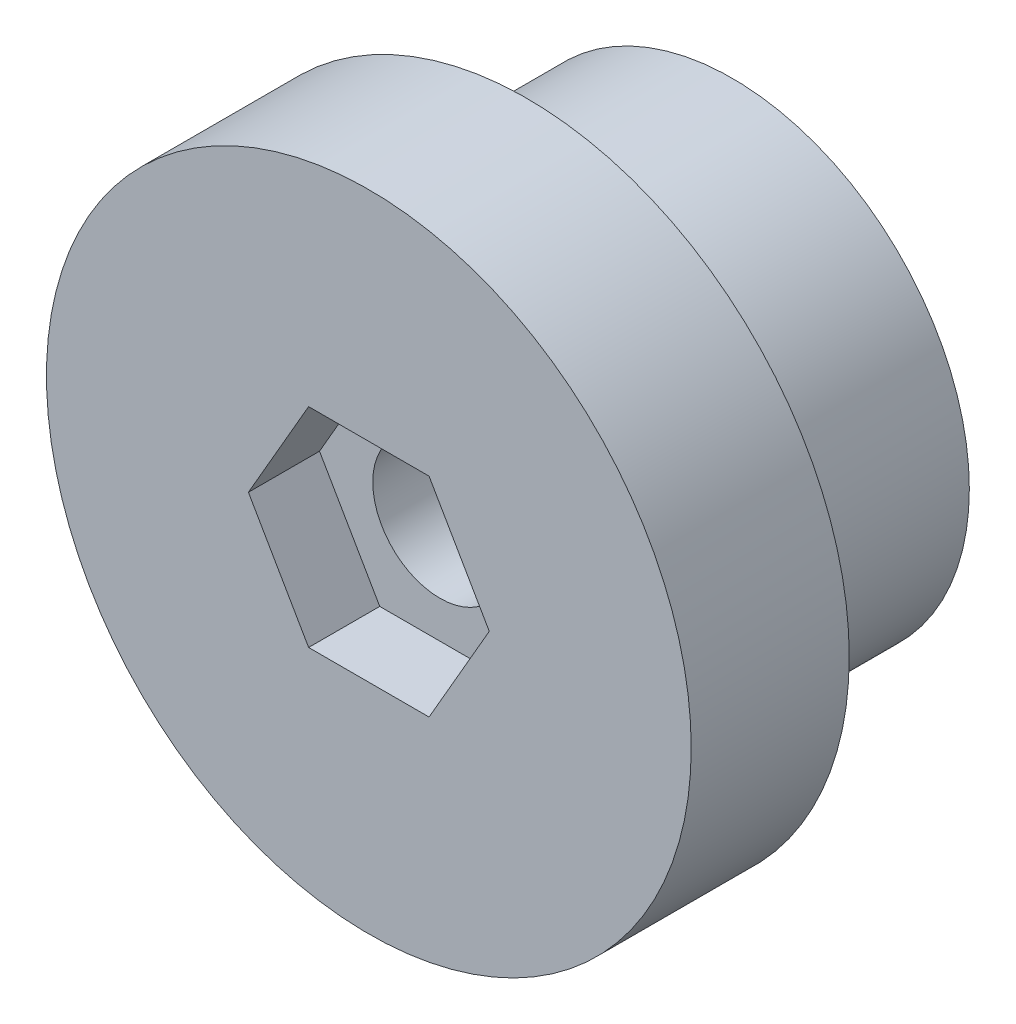
ISO-10303-21;
HEADER;
FILE_DESCRIPTION(('STEP AP214'),'2;1');
FILE_NAME('part.step','',(''),(''),'','','');
FILE_SCHEMA(('AUTOMOTIVE_DESIGN { 1 0 10303 214 1 1 1 1 }'));
ENDSEC;
DATA;
#1=APPLICATION_CONTEXT('core data for automotive mechanical design processes');
#2=APPLICATION_PROTOCOL_DEFINITION('international standard','automotive_design',2000,#1);
#3=PRODUCT_CONTEXT('',#1,'mechanical');
#4=PRODUCT('Part','Part','',(#3));
#5=PRODUCT_RELATED_PRODUCT_CATEGORY('part','',(#4));
#6=PRODUCT_DEFINITION_FORMATION('','',#4);
#7=PRODUCT_DEFINITION_CONTEXT('part definition',#1,'design');
#8=PRODUCT_DEFINITION('design','',#6,#7);
#9=PRODUCT_DEFINITION_SHAPE('','',#8);
#10=(LENGTH_UNIT() NAMED_UNIT(*) SI_UNIT(.MILLI.,.METRE.));
#11=(NAMED_UNIT(*) PLANE_ANGLE_UNIT() SI_UNIT($,.RADIAN.));
#12=(NAMED_UNIT(*) SI_UNIT($,.STERADIAN.) SOLID_ANGLE_UNIT());
#13=UNCERTAINTY_MEASURE_WITH_UNIT(LENGTH_MEASURE(1.E-05),#10,'distance_accuracy_value','');
#14=(GEOMETRIC_REPRESENTATION_CONTEXT(3) GLOBAL_UNCERTAINTY_ASSIGNED_CONTEXT((#13)) GLOBAL_UNIT_ASSIGNED_CONTEXT((#10,
#11,#12)) REPRESENTATION_CONTEXT('',''));
#15=CARTESIAN_POINT('',(0.,0.,0.));
#16=DIRECTION('',(0.,0.,1.));
#17=DIRECTION('',(1.,0.,0.));
#18=AXIS2_PLACEMENT_3D('',#15,#16,#17);
#19=CARTESIAN_POINT('',(0.,0.,0.));
#20=DIRECTION('',(0.,0.,1.));
#21=DIRECTION('',(1.,0.,0.));
#22=AXIS2_PLACEMENT_3D('',#19,#20,#21);
#23=PLANE('',#22);
#24=CARTESIAN_POINT('',(0.,0.,0.));
#25=DIRECTION('',(0.,0.,1.));
#26=DIRECTION('',(1.,0.,0.));
#27=AXIS2_PLACEMENT_3D('',#24,#25,#26);
#28=CIRCLE('',#27,20.4);
#29=CARTESIAN_POINT('',(20.4,0.,0.));
#30=VERTEX_POINT('',#29);
#31=EDGE_CURVE('E144',#30,#30,#28,.T.);
#32=ORIENTED_EDGE('',*,*,#31,.F.);
#33=EDGE_LOOP('',(#32));
#34=FACE_BOUND('',#33,.T.);
#35=CARTESIAN_POINT('',(0.,0.,0.));
#36=DIRECTION('',(0.,0.,1.));
#37=DIRECTION('',(1.,0.,0.));
#38=AXIS2_PLACEMENT_3D('',#35,#36,#37);
#39=CIRCLE('',#38,15.);
#40=CARTESIAN_POINT('',(15.,0.,0.));
#41=VERTEX_POINT('',#40);
#42=EDGE_CURVE('E11',#41,#41,#39,.F.);
#43=ORIENTED_EDGE('',*,*,#42,.F.);
#44=EDGE_LOOP('',(#43));
#45=FACE_BOUND('',#44,.T.);
#46=ADVANCED_FACE('F33',(#34,#45),#23,.F.);
#47=CARTESIAN_POINT('',(0.,0.,10.));
#48=DIRECTION('',(0.,0.,-1.));
#49=DIRECTION('',(-1.,0.,0.));
#50=AXIS2_PLACEMENT_3D('',#47,#48,#49);
#51=CYLINDRICAL_SURFACE('',#50,4.25);
#52=CARTESIAN_POINT('',(0.,0.,5.5));
#53=DIRECTION('',(0.,0.,1.));
#54=DIRECTION('',(1.,0.,0.));
#55=AXIS2_PLACEMENT_3D('',#52,#53,#54);
#56=CIRCLE('',#55,4.25);
#57=CARTESIAN_POINT('',(4.25,0.,5.5));
#58=VERTEX_POINT('',#57);
#59=EDGE_CURVE('E136',#58,#58,#56,.T.);
#60=ORIENTED_EDGE('',*,*,#59,.T.);
#61=EDGE_LOOP('',(#60));
#62=FACE_BOUND('',#61,.T.);
#63=CARTESIAN_POINT('',(0.,0.,-13.));
#64=DIRECTION('',(0.,0.,-1.));
#65=DIRECTION('',(-1.,0.,0.));
#66=AXIS2_PLACEMENT_3D('',#63,#64,#65);
#67=CIRCLE('',#66,4.25);
#68=CARTESIAN_POINT('',(-4.25,0.,-13.));
#69=VERTEX_POINT('',#68);
#70=EDGE_CURVE('E204',#69,#69,#67,.T.);
#71=ORIENTED_EDGE('',*,*,#70,.T.);
#72=EDGE_LOOP('',(#71));
#73=FACE_BOUND('',#72,.T.);
#74=ADVANCED_FACE('F149',(#62,#73),#51,.F.);
#75=CARTESIAN_POINT('',(0.,0.,10.));
#76=DIRECTION('',(0.,0.,1.));
#77=DIRECTION('',(1.,0.,0.));
#78=AXIS2_PLACEMENT_3D('',#75,#76,#77);
#79=PLANE('',#78);
#80=DIRECTION('',(1.,0.,0.));
#81=VECTOR('',#80,1.);
#82=CARTESIAN_POINT('',(-3.81051177665153,-6.6,10.));
#83=LINE('',#82,#81);
#84=CARTESIAN_POINT('',(-3.81051177665153,-6.6,10.));
#85=VERTEX_POINT('',#84);
#86=CARTESIAN_POINT('',(3.81051177665153,-6.6,10.));
#87=VERTEX_POINT('',#86);
#88=EDGE_CURVE('E48',#85,#87,#83,.T.);
#89=ORIENTED_EDGE('',*,*,#88,.F.);
#90=DIRECTION('',(0.5,-0.866025403784439,0.));
#91=VECTOR('',#90,1.);
#92=CARTESIAN_POINT('',(-7.62102355330306,0.,10.));
#93=LINE('',#92,#91);
#94=CARTESIAN_POINT('',(-7.62102355330306,0.,10.));
#95=VERTEX_POINT('',#94);
#96=EDGE_CURVE('E132',#95,#85,#93,.T.);
#97=ORIENTED_EDGE('',*,*,#96,.F.);
#98=DIRECTION('',(-0.5,-0.866025403784438,0.));
#99=VECTOR('',#98,1.);
#100=CARTESIAN_POINT('',(-3.81051177665153,6.6,10.));
#101=LINE('',#100,#99);
#102=CARTESIAN_POINT('',(-3.81051177665153,6.6,10.));
#103=VERTEX_POINT('',#102);
#104=EDGE_CURVE('E130',#103,#95,#101,.T.);
#105=ORIENTED_EDGE('',*,*,#104,.F.);
#106=DIRECTION('',(-1.,0.,0.));
#107=VECTOR('',#106,1.);
#108=CARTESIAN_POINT('',(3.81051177665153,6.6,10.));
#109=LINE('',#108,#107);
#110=CARTESIAN_POINT('',(3.81051177665153,6.6,10.));
#111=VERTEX_POINT('',#110);
#112=EDGE_CURVE('E96',#111,#103,#109,.T.);
#113=ORIENTED_EDGE('',*,*,#112,.F.);
#114=DIRECTION('',(-0.5,0.866025403784439,0.));
#115=VECTOR('',#114,1.);
#116=CARTESIAN_POINT('',(7.62102355330306,0.,10.));
#117=LINE('',#116,#115);
#118=CARTESIAN_POINT('',(7.62102355330306,0.,10.));
#119=VERTEX_POINT('',#118);
#120=EDGE_CURVE('E126',#119,#111,#117,.T.);
#121=ORIENTED_EDGE('',*,*,#120,.F.);
#122=DIRECTION('',(0.5,0.866025403784439,0.));
#123=VECTOR('',#122,1.);
#124=CARTESIAN_POINT('',(3.81051177665153,-6.6,10.));
#125=LINE('',#124,#123);
#126=EDGE_CURVE('E122',#87,#119,#125,.T.);
#127=ORIENTED_EDGE('',*,*,#126,.F.);
#128=EDGE_LOOP('',(#89,#97,#105,#113,#121,#127));
#129=FACE_BOUND('',#128,.T.);
#130=CARTESIAN_POINT('',(0.,0.,10.));
#131=DIRECTION('',(0.,0.,1.));
#132=DIRECTION('',(1.,0.,0.));
#133=AXIS2_PLACEMENT_3D('',#130,#131,#132);
#134=CIRCLE('',#133,20.4);
#135=CARTESIAN_POINT('',(20.4,0.,10.));
#136=VERTEX_POINT('',#135);
#137=EDGE_CURVE('E41',#136,#136,#134,.T.);
#138=ORIENTED_EDGE('',*,*,#137,.T.);
#139=EDGE_LOOP('',(#138));
#140=FACE_BOUND('',#139,.T.);
#141=ADVANCED_FACE('F175',(#129,#140),#79,.T.);
#142=CARTESIAN_POINT('',(0.,0.,10.));
#143=DIRECTION('',(0.,0.,-1.));
#144=DIRECTION('',(-1.,0.,0.));
#145=AXIS2_PLACEMENT_3D('',#142,#143,#144);
#146=CYLINDRICAL_SURFACE('',#145,20.4);
#147=ORIENTED_EDGE('',*,*,#137,.F.);
#148=EDGE_LOOP('',(#147));
#149=FACE_BOUND('',#148,.T.);
#150=ORIENTED_EDGE('',*,*,#31,.T.);
#151=EDGE_LOOP('',(#150));
#152=FACE_BOUND('',#151,.T.);
#153=ADVANCED_FACE('F35',(#149,#152),#146,.T.);
#154=CARTESIAN_POINT('',(-3.81051177665153,-6.6,5.5));
#155=DIRECTION('',(0.,-1.,0.));
#156=DIRECTION('',(1.,0.,0.));
#157=AXIS2_PLACEMENT_3D('',#154,#155,#156);
#158=PLANE('',#157);
#159=ORIENTED_EDGE('',*,*,#88,.T.);
#160=DIRECTION('',(0.,0.,1.));
#161=VECTOR('',#160,1.);
#162=CARTESIAN_POINT('',(3.81051177665153,-6.6,5.5));
#163=LINE('',#162,#161);
#164=CARTESIAN_POINT('',(3.81051177665153,-6.6,5.5));
#165=VERTEX_POINT('',#164);
#166=EDGE_CURVE('E78',#165,#87,#163,.T.);
#167=ORIENTED_EDGE('',*,*,#166,.F.);
#168=DIRECTION('',(1.,0.,0.));
#169=VECTOR('',#168,1.);
#170=CARTESIAN_POINT('',(-3.81051177665153,-6.6,5.5));
#171=LINE('',#170,#169);
#172=CARTESIAN_POINT('',(-3.81051177665153,-6.6,5.5));
#173=VERTEX_POINT('',#172);
#174=EDGE_CURVE('E134',#173,#165,#171,.T.);
#175=ORIENTED_EDGE('',*,*,#174,.F.);
#176=DIRECTION('',(0.,0.,1.));
#177=VECTOR('',#176,1.);
#178=CARTESIAN_POINT('',(-3.81051177665153,-6.6,5.5));
#179=LINE('',#178,#177);
#180=EDGE_CURVE('E56',#173,#85,#179,.T.);
#181=ORIENTED_EDGE('',*,*,#180,.T.);
#182=EDGE_LOOP('',(#159,#167,#175,#181));
#183=FACE_BOUND('',#182,.T.);
#184=ADVANCED_FACE('F183',(#183),#158,.F.);
#185=CARTESIAN_POINT('',(-7.62102355330306,0.,5.5));
#186=DIRECTION('',(-0.866025403784439,-0.5,0.));
#187=DIRECTION('',(0.5,-0.866025403784439,0.));
#188=AXIS2_PLACEMENT_3D('',#185,#186,#187);
#189=PLANE('',#188);
#190=ORIENTED_EDGE('',*,*,#96,.T.);
#191=ORIENTED_EDGE('',*,*,#180,.F.);
#192=DIRECTION('',(0.5,-0.866025403784439,0.));
#193=VECTOR('',#192,1.);
#194=CARTESIAN_POINT('',(-7.62102355330306,0.,5.5));
#195=LINE('',#194,#193);
#196=CARTESIAN_POINT('',(-7.62102355330306,0.,5.5));
#197=VERTEX_POINT('',#196);
#198=EDGE_CURVE('E108',#197,#173,#195,.T.);
#199=ORIENTED_EDGE('',*,*,#198,.F.);
#200=DIRECTION('',(0.,0.,1.));
#201=VECTOR('',#200,1.);
#202=CARTESIAN_POINT('',(-7.62102355330306,0.,5.5));
#203=LINE('',#202,#201);
#204=EDGE_CURVE('E100',#197,#95,#203,.T.);
#205=ORIENTED_EDGE('',*,*,#204,.T.);
#206=EDGE_LOOP('',(#190,#191,#199,#205));
#207=FACE_BOUND('',#206,.T.);
#208=ADVANCED_FACE('F185',(#207),#189,.F.);
#209=CARTESIAN_POINT('',(-3.81051177665153,6.6,5.5));
#210=DIRECTION('',(-0.866025403784439,0.5,0.));
#211=DIRECTION('',(-0.5,-0.866025403784439,0.));
#212=AXIS2_PLACEMENT_3D('',#209,#210,#211);
#213=PLANE('',#212);
#214=ORIENTED_EDGE('',*,*,#104,.T.);
#215=ORIENTED_EDGE('',*,*,#204,.F.);
#216=DIRECTION('',(-0.5,-0.866025403784438,0.));
#217=VECTOR('',#216,1.);
#218=CARTESIAN_POINT('',(-3.81051177665153,6.6,5.5));
#219=LINE('',#218,#217);
#220=CARTESIAN_POINT('',(-3.81051177665153,6.6,5.5));
#221=VERTEX_POINT('',#220);
#222=EDGE_CURVE('E104',#221,#197,#219,.T.);
#223=ORIENTED_EDGE('',*,*,#222,.F.);
#224=DIRECTION('',(0.,0.,1.));
#225=VECTOR('',#224,1.);
#226=CARTESIAN_POINT('',(-3.81051177665153,6.6,5.5));
#227=LINE('',#226,#225);
#228=EDGE_CURVE('E89',#221,#103,#227,.T.);
#229=ORIENTED_EDGE('',*,*,#228,.T.);
#230=EDGE_LOOP('',(#214,#215,#223,#229));
#231=FACE_BOUND('',#230,.T.);
#232=ADVANCED_FACE('F105',(#231),#213,.F.);
#233=CARTESIAN_POINT('',(3.81051177665153,6.6,5.5));
#234=DIRECTION('',(0.,1.,0.));
#235=DIRECTION('',(0.,0.,1.));
#236=AXIS2_PLACEMENT_3D('',#233,#234,#235);
#237=PLANE('',#236);
#238=ORIENTED_EDGE('',*,*,#112,.T.);
#239=ORIENTED_EDGE('',*,*,#228,.F.);
#240=DIRECTION('',(-1.,0.,0.));
#241=VECTOR('',#240,1.);
#242=CARTESIAN_POINT('',(3.81051177665153,6.6,5.5));
#243=LINE('',#242,#241);
#244=CARTESIAN_POINT('',(3.81051177665153,6.6,5.5));
#245=VERTEX_POINT('',#244);
#246=EDGE_CURVE('E93',#245,#221,#243,.T.);
#247=ORIENTED_EDGE('',*,*,#246,.F.);
#248=DIRECTION('',(0.,0.,1.));
#249=VECTOR('',#248,1.);
#250=CARTESIAN_POINT('',(3.81051177665153,6.6,5.5));
#251=LINE('',#250,#249);
#252=EDGE_CURVE('E101',#245,#111,#251,.T.);
#253=ORIENTED_EDGE('',*,*,#252,.T.);
#254=EDGE_LOOP('',(#238,#239,#247,#253));
#255=FACE_BOUND('',#254,.T.);
#256=ADVANCED_FACE('F91',(#255),#237,.F.);
#257=CARTESIAN_POINT('',(7.62102355330306,0.,5.5));
#258=DIRECTION('',(0.866025403784439,0.5,0.));
#259=DIRECTION('',(-0.5,0.866025403784439,0.));
#260=AXIS2_PLACEMENT_3D('',#257,#258,#259);
#261=PLANE('',#260);
#262=ORIENTED_EDGE('',*,*,#120,.T.);
#263=ORIENTED_EDGE('',*,*,#252,.F.);
#264=DIRECTION('',(-0.5,0.866025403784439,0.));
#265=VECTOR('',#264,1.);
#266=CARTESIAN_POINT('',(7.62102355330306,0.,5.5));
#267=LINE('',#266,#265);
#268=CARTESIAN_POINT('',(7.62102355330306,0.,5.5));
#269=VERTEX_POINT('',#268);
#270=EDGE_CURVE('E114',#269,#245,#267,.T.);
#271=ORIENTED_EDGE('',*,*,#270,.F.);
#272=DIRECTION('',(0.,0.,1.));
#273=VECTOR('',#272,1.);
#274=CARTESIAN_POINT('',(7.62102355330306,0.,5.5));
#275=LINE('',#274,#273);
#276=EDGE_CURVE('E139',#269,#119,#275,.T.);
#277=ORIENTED_EDGE('',*,*,#276,.T.);
#278=EDGE_LOOP('',(#262,#263,#271,#277));
#279=FACE_BOUND('',#278,.T.);
#280=ADVANCED_FACE('F164',(#279),#261,.F.);
#281=CARTESIAN_POINT('',(3.81051177665153,-6.6,5.5));
#282=DIRECTION('',(0.866025403784439,-0.5,0.));
#283=DIRECTION('',(0.5,0.866025403784439,0.));
#284=AXIS2_PLACEMENT_3D('',#281,#282,#283);
#285=PLANE('',#284);
#286=ORIENTED_EDGE('',*,*,#126,.T.);
#287=ORIENTED_EDGE('',*,*,#276,.F.);
#288=DIRECTION('',(0.5,0.866025403784439,0.));
#289=VECTOR('',#288,1.);
#290=CARTESIAN_POINT('',(3.81051177665153,-6.6,5.5));
#291=LINE('',#290,#289);
#292=EDGE_CURVE('E116',#165,#269,#291,.T.);
#293=ORIENTED_EDGE('',*,*,#292,.F.);
#294=ORIENTED_EDGE('',*,*,#166,.T.);
#295=EDGE_LOOP('',(#286,#287,#293,#294));
#296=FACE_BOUND('',#295,.T.);
#297=ADVANCED_FACE('F154',(#296),#285,.F.);
#298=CARTESIAN_POINT('',(0.,0.,5.5));
#299=DIRECTION('',(0.,0.,1.));
#300=DIRECTION('',(1.,0.,0.));
#301=AXIS2_PLACEMENT_3D('',#298,#299,#300);
#302=PLANE('',#301);
#303=ORIENTED_EDGE('',*,*,#59,.F.);
#304=EDGE_LOOP('',(#303));
#305=FACE_BOUND('',#304,.T.);
#306=ORIENTED_EDGE('',*,*,#174,.T.);
#307=ORIENTED_EDGE('',*,*,#292,.T.);
#308=ORIENTED_EDGE('',*,*,#270,.T.);
#309=ORIENTED_EDGE('',*,*,#246,.T.);
#310=ORIENTED_EDGE('',*,*,#222,.T.);
#311=ORIENTED_EDGE('',*,*,#198,.T.);
#312=EDGE_LOOP('',(#306,#307,#308,#309,#310,#311));
#313=FACE_BOUND('',#312,.T.);
#314=ADVANCED_FACE('F111',(#305,#313),#302,.T.);
#315=CARTESIAN_POINT('',(0.,0.,-13.));
#316=DIRECTION('',(0.,0.,-1.));
#317=DIRECTION('',(-1.,0.,0.));
#318=AXIS2_PLACEMENT_3D('',#315,#316,#317);
#319=PLANE('',#318);
#320=CARTESIAN_POINT('',(0.,0.,-13.));
#321=DIRECTION('',(0.,0.,-1.));
#322=DIRECTION('',(-1.,0.,0.));
#323=AXIS2_PLACEMENT_3D('',#320,#321,#322);
#324=CIRCLE('',#323,15.);
#325=CARTESIAN_POINT('',(-15.,0.,-13.));
#326=VERTEX_POINT('',#325);
#327=EDGE_CURVE('E123',#326,#326,#324,.T.);
#328=ORIENTED_EDGE('',*,*,#327,.T.);
#329=EDGE_LOOP('',(#328));
#330=FACE_BOUND('',#329,.T.);
#331=ORIENTED_EDGE('',*,*,#70,.F.);
#332=EDGE_LOOP('',(#331));
#333=FACE_BOUND('',#332,.T.);
#334=ADVANCED_FACE('F153',(#330,#333),#319,.T.);
#335=CARTESIAN_POINT('',(0.,0.,-13.));
#336=DIRECTION('',(0.,0.,1.));
#337=DIRECTION('',(1.,0.,0.));
#338=AXIS2_PLACEMENT_3D('',#335,#336,#337);
#339=CYLINDRICAL_SURFACE('',#338,15.);
#340=ORIENTED_EDGE('',*,*,#327,.F.);
#341=EDGE_LOOP('',(#340));
#342=FACE_BOUND('',#341,.T.);
#343=ORIENTED_EDGE('',*,*,#42,.T.);
#344=EDGE_LOOP('',(#343));
#345=FACE_BOUND('',#344,.T.);
#346=ADVANCED_FACE('F161',(#342,#345),#339,.T.);
#347=CLOSED_SHELL('',(#46,#74,#141,#153,#184,#208,#232,#256,#280,#297,#314,#334,#346));
#348=MANIFOLD_SOLID_BREP('B2',#347);
#349=ADVANCED_BREP_SHAPE_REPRESENTATION('',(#18,#348),#14);
#350=SHAPE_DEFINITION_REPRESENTATION(#9,#349);
ENDSEC;
END-ISO-10303-21;
